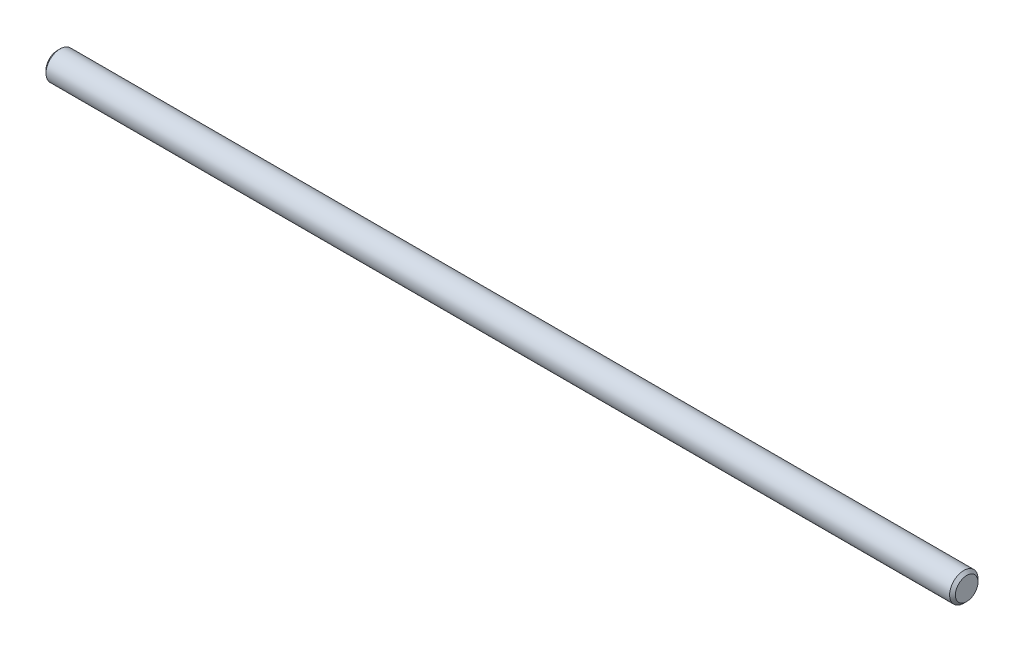
ISO-10303-21;
HEADER;
FILE_DESCRIPTION(('STEP AP214'),'2;1');
FILE_NAME('part.step','',(''),(''),'','','');
FILE_SCHEMA(('AUTOMOTIVE_DESIGN { 1 0 10303 214 1 1 1 1 }'));
ENDSEC;
DATA;
#1=APPLICATION_CONTEXT('core data for automotive mechanical design processes');
#2=APPLICATION_PROTOCOL_DEFINITION('international standard','automotive_design',2000,#1);
#3=PRODUCT_CONTEXT('',#1,'mechanical');
#4=PRODUCT('Part','Part','',(#3));
#5=PRODUCT_RELATED_PRODUCT_CATEGORY('part','',(#4));
#6=PRODUCT_DEFINITION_FORMATION('','',#4);
#7=PRODUCT_DEFINITION_CONTEXT('part definition',#1,'design');
#8=PRODUCT_DEFINITION('design','',#6,#7);
#9=PRODUCT_DEFINITION_SHAPE('','',#8);
#10=(LENGTH_UNIT() NAMED_UNIT(*) SI_UNIT(.MILLI.,.METRE.));
#11=(NAMED_UNIT(*) PLANE_ANGLE_UNIT() SI_UNIT($,.RADIAN.));
#12=(NAMED_UNIT(*) SI_UNIT($,.STERADIAN.) SOLID_ANGLE_UNIT());
#13=UNCERTAINTY_MEASURE_WITH_UNIT(LENGTH_MEASURE(1.E-05),#10,'distance_accuracy_value','');
#14=(GEOMETRIC_REPRESENTATION_CONTEXT(3) GLOBAL_UNCERTAINTY_ASSIGNED_CONTEXT((#13)) GLOBAL_UNIT_ASSIGNED_CONTEXT((#10,
#11,#12)) REPRESENTATION_CONTEXT('',''));
#15=CARTESIAN_POINT('',(0.,0.,0.));
#16=DIRECTION('',(0.,0.,1.));
#17=DIRECTION('',(1.,0.,0.));
#18=AXIS2_PLACEMENT_3D('',#15,#16,#17);
#19=CARTESIAN_POINT('',(-48.,0.,0.));
#20=DIRECTION('',(1.,0.,0.));
#21=DIRECTION('',(0.,1.,0.));
#22=AXIS2_PLACEMENT_3D('',#19,#20,#21);
#23=PLANE('',#22);
#24=CARTESIAN_POINT('',(-48.,0.,0.));
#25=DIRECTION('',(-1.,0.,0.));
#26=DIRECTION('',(0.,-1.,0.));
#27=AXIS2_PLACEMENT_3D('',#24,#25,#26);
#28=CIRCLE('',#27,1.19350000000001);
#29=CARTESIAN_POINT('',(-48.,-1.19350000000002,0.));
#30=VERTEX_POINT('',#29);
#31=EDGE_CURVE('E10',#30,#30,#28,.T.);
#32=ORIENTED_EDGE('',*,*,#31,.T.);
#33=EDGE_LOOP('',(#32));
#34=FACE_BOUND('',#33,.T.);
#35=ADVANCED_FACE('F35',(#34),#23,.F.);
#36=CARTESIAN_POINT('',(-47.6935,0.,0.));
#37=DIRECTION('',(1.,0.,0.));
#38=DIRECTION('',(0.,1.,0.));
#39=AXIS2_PLACEMENT_3D('',#36,#37,#38);
#40=CONICAL_SURFACE('',#39,1.50000000000001,0.785398163397447);
#41=ORIENTED_EDGE('',*,*,#31,.F.);
#42=EDGE_LOOP('',(#41));
#43=FACE_BOUND('',#42,.T.);
#44=CARTESIAN_POINT('',(-47.6935,0.,0.));
#45=DIRECTION('',(-1.,0.,0.));
#46=DIRECTION('',(0.,-1.,0.));
#47=AXIS2_PLACEMENT_3D('',#44,#45,#46);
#48=CIRCLE('',#47,1.50000000000001);
#49=CARTESIAN_POINT('',(-47.6935,-1.50000000000002,0.));
#50=VERTEX_POINT('',#49);
#51=EDGE_CURVE('E41',#50,#50,#48,.T.);
#52=ORIENTED_EDGE('',*,*,#51,.T.);
#53=EDGE_LOOP('',(#52));
#54=FACE_BOUND('',#53,.T.);
#55=ADVANCED_FACE('F67',(#43,#54),#40,.T.);
#56=CARTESIAN_POINT('',(48.,0.,0.));
#57=DIRECTION('',(-1.,0.,0.));
#58=DIRECTION('',(0.,-1.,0.));
#59=AXIS2_PLACEMENT_3D('',#56,#57,#58);
#60=CYLINDRICAL_SURFACE('',#59,1.50000000000001);
#61=ORIENTED_EDGE('',*,*,#51,.F.);
#62=EDGE_LOOP('',(#61));
#63=FACE_BOUND('',#62,.T.);
#64=CARTESIAN_POINT('',(47.6935,0.,0.));
#65=DIRECTION('',(-1.,0.,0.));
#66=DIRECTION('',(0.,-1.,0.));
#67=AXIS2_PLACEMENT_3D('',#64,#65,#66);
#68=CIRCLE('',#67,1.5);
#69=CARTESIAN_POINT('',(47.6935,-1.5,0.));
#70=VERTEX_POINT('',#69);
#71=EDGE_CURVE('E45',#70,#70,#68,.T.);
#72=ORIENTED_EDGE('',*,*,#71,.T.);
#73=EDGE_LOOP('',(#72));
#74=FACE_BOUND('',#73,.T.);
#75=ADVANCED_FACE('F63',(#63,#74),#60,.T.);
#76=CARTESIAN_POINT('',(48.,0.,0.));
#77=DIRECTION('',(-1.,0.,0.));
#78=DIRECTION('',(0.,-1.,0.));
#79=AXIS2_PLACEMENT_3D('',#76,#77,#78);
#80=CONICAL_SURFACE('',#79,1.1935,0.785398163397447);
#81=ORIENTED_EDGE('',*,*,#71,.F.);
#82=EDGE_LOOP('',(#81));
#83=FACE_BOUND('',#82,.T.);
#84=CARTESIAN_POINT('',(48.,0.,0.));
#85=DIRECTION('',(-1.,0.,0.));
#86=DIRECTION('',(0.,-1.,0.));
#87=AXIS2_PLACEMENT_3D('',#84,#85,#86);
#88=CIRCLE('',#87,1.1935);
#89=CARTESIAN_POINT('',(48.,-1.1935,0.));
#90=VERTEX_POINT('',#89);
#91=EDGE_CURVE('E49',#90,#90,#88,.T.);
#92=ORIENTED_EDGE('',*,*,#91,.T.);
#93=EDGE_LOOP('',(#92));
#94=FACE_BOUND('',#93,.T.);
#95=ADVANCED_FACE('F55',(#83,#94),#80,.T.);
#96=CARTESIAN_POINT('',(48.,1.1935,0.));
#97=DIRECTION('',(-1.,0.,0.));
#98=DIRECTION('',(0.,-1.,0.));
#99=AXIS2_PLACEMENT_3D('',#96,#97,#98);
#100=PLANE('',#99);
#101=ORIENTED_EDGE('',*,*,#91,.F.);
#102=EDGE_LOOP('',(#101));
#103=FACE_BOUND('',#102,.T.);
#104=ADVANCED_FACE('F57',(#103),#100,.F.);
#105=CLOSED_SHELL('',(#35,#55,#75,#95,#104));
#106=MANIFOLD_SOLID_BREP('B2',#105);
#107=ADVANCED_BREP_SHAPE_REPRESENTATION('',(#18,#106),#14);
#108=SHAPE_DEFINITION_REPRESENTATION(#9,#107);
ENDSEC;
END-ISO-10303-21;
